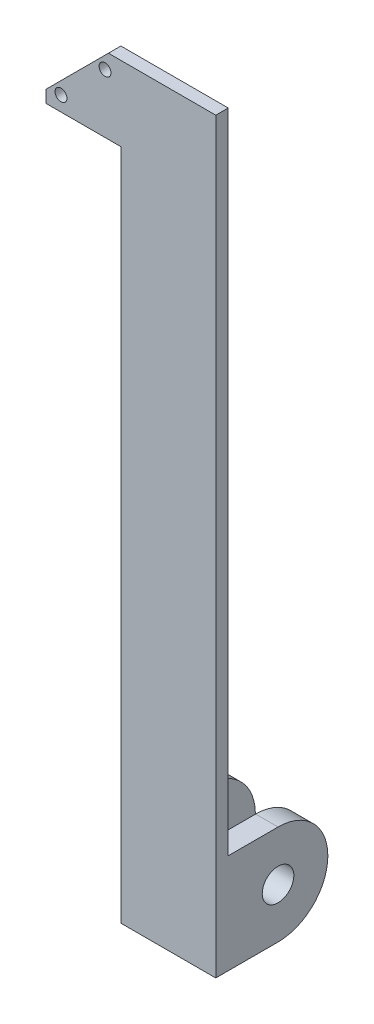
ISO-10303-21;
HEADER;
FILE_DESCRIPTION(('STEP AP214'),'2;1');
FILE_NAME('part.step','',(''),(''),'','','');
FILE_SCHEMA(('AUTOMOTIVE_DESIGN { 1 0 10303 214 1 1 1 1 }'));
ENDSEC;
DATA;
#1=APPLICATION_CONTEXT('core data for automotive mechanical design processes');
#2=APPLICATION_PROTOCOL_DEFINITION('international standard','automotive_design',2000,#1);
#3=PRODUCT_CONTEXT('',#1,'mechanical');
#4=PRODUCT('Part','Part','',(#3));
#5=PRODUCT_RELATED_PRODUCT_CATEGORY('part','',(#4));
#6=PRODUCT_DEFINITION_FORMATION('','',#4);
#7=PRODUCT_DEFINITION_CONTEXT('part definition',#1,'design');
#8=PRODUCT_DEFINITION('design','',#6,#7);
#9=PRODUCT_DEFINITION_SHAPE('','',#8);
#10=(LENGTH_UNIT() NAMED_UNIT(*) SI_UNIT(.MILLI.,.METRE.));
#11=(NAMED_UNIT(*) PLANE_ANGLE_UNIT() SI_UNIT($,.RADIAN.));
#12=(NAMED_UNIT(*) SI_UNIT($,.STERADIAN.) SOLID_ANGLE_UNIT());
#13=UNCERTAINTY_MEASURE_WITH_UNIT(LENGTH_MEASURE(1.E-05),#10,'distance_accuracy_value','');
#14=(GEOMETRIC_REPRESENTATION_CONTEXT(3) GLOBAL_UNCERTAINTY_ASSIGNED_CONTEXT((#13)) GLOBAL_UNIT_ASSIGNED_CONTEXT((#10,
#11,#12)) REPRESENTATION_CONTEXT('',''));
#15=CARTESIAN_POINT('',(0.,0.,0.));
#16=DIRECTION('',(0.,0.,1.));
#17=DIRECTION('',(1.,0.,0.));
#18=AXIS2_PLACEMENT_3D('',#15,#16,#17);
#19=CARTESIAN_POINT('',(0.,0.,5.));
#20=DIRECTION('',(-1.,0.,0.));
#21=DIRECTION('',(0.,0.,1.));
#22=AXIS2_PLACEMENT_3D('',#19,#20,#21);
#23=PLANE('',#22);
#24=CARTESIAN_POINT('',(0.,20.,-20.));
#25=DIRECTION('',(-1.,0.,0.));
#26=DIRECTION('',(0.,0.,1.));
#27=AXIS2_PLACEMENT_3D('',#24,#25,#26);
#28=CIRCLE('',#27,6.35);
#29=CARTESIAN_POINT('',(0.,20.,-13.65));
#30=VERTEX_POINT('',#29);
#31=EDGE_CURVE('E245',#30,#30,#28,.T.);
#32=ORIENTED_EDGE('',*,*,#31,.F.);
#33=EDGE_LOOP('',(#32));
#34=FACE_BOUND('',#33,.T.);
#35=DIRECTION('',(0.,1.,0.));
#36=VECTOR('',#35,1.);
#37=CARTESIAN_POINT('',(0.,0.,-40.));
#38=LINE('',#37,#36);
#39=CARTESIAN_POINT('',(0.,19.99,-40.));
#40=VERTEX_POINT('',#39);
#41=CARTESIAN_POINT('',(0.,20.0099999999999,-40.));
#42=VERTEX_POINT('',#41);
#43=EDGE_CURVE('E226',#40,#42,#38,.T.);
#44=ORIENTED_EDGE('',*,*,#43,.F.);
#45=CARTESIAN_POINT('',(0.,19.99,-20.01));
#46=DIRECTION('',(-1.,0.,0.));
#47=DIRECTION('',(0.,0.,1.));
#48=AXIS2_PLACEMENT_3D('',#45,#46,#47);
#49=CIRCLE('',#48,19.99);
#50=CARTESIAN_POINT('',(0.,0.,-20.0099999999999));
#51=VERTEX_POINT('',#50);
#52=EDGE_CURVE('E435',#40,#51,#49,.T.);
#53=ORIENTED_EDGE('',*,*,#52,.T.);
#54=DIRECTION('',(0.,0.,-1.));
#55=VECTOR('',#54,1.);
#56=CARTESIAN_POINT('',(0.,0.,5.));
#57=LINE('',#56,#55);
#58=CARTESIAN_POINT('',(0.,0.,5.));
#59=VERTEX_POINT('',#58);
#60=EDGE_CURVE('E205',#59,#51,#57,.T.);
#61=ORIENTED_EDGE('',*,*,#60,.F.);
#62=DIRECTION('',(0.,1.,0.));
#63=VECTOR('',#62,1.);
#64=CARTESIAN_POINT('',(0.,0.,5.));
#65=LINE('',#64,#63);
#66=CARTESIAN_POINT('',(0.,270.,5.));
#67=VERTEX_POINT('',#66);
#68=EDGE_CURVE('E279',#59,#67,#65,.T.);
#69=ORIENTED_EDGE('',*,*,#68,.T.);
#70=DIRECTION('',(0.,0.,-1.));
#71=VECTOR('',#70,1.);
#72=CARTESIAN_POINT('',(0.,270.,5.));
#73=LINE('',#72,#71);
#74=CARTESIAN_POINT('',(0.,270.,0.));
#75=VERTEX_POINT('',#74);
#76=EDGE_CURVE('E208',#67,#75,#73,.T.);
#77=ORIENTED_EDGE('',*,*,#76,.T.);
#78=DIRECTION('',(0.,1.,0.));
#79=VECTOR('',#78,1.);
#80=CARTESIAN_POINT('',(0.,0.,0.));
#81=LINE('',#80,#79);
#82=CARTESIAN_POINT('',(0.,40.,0.));
#83=VERTEX_POINT('',#82);
#84=EDGE_CURVE('E301',#83,#75,#81,.T.);
#85=ORIENTED_EDGE('',*,*,#84,.F.);
#86=DIRECTION('',(0.,0.,1.));
#87=VECTOR('',#86,1.);
#88=CARTESIAN_POINT('',(0.,40.,-40.));
#89=LINE('',#88,#87);
#90=CARTESIAN_POINT('',(0.,40.,-20.0099999999999));
#91=VERTEX_POINT('',#90);
#92=EDGE_CURVE('E239',#91,#83,#89,.T.);
#93=ORIENTED_EDGE('',*,*,#92,.F.);
#94=CARTESIAN_POINT('',(0.,20.01,-20.01));
#95=DIRECTION('',(-1.,0.,0.));
#96=DIRECTION('',(0.,0.,1.));
#97=AXIS2_PLACEMENT_3D('',#94,#95,#96);
#98=CIRCLE('',#97,19.99);
#99=EDGE_CURVE('E436',#91,#42,#98,.T.);
#100=ORIENTED_EDGE('',*,*,#99,.T.);
#101=EDGE_LOOP('',(#44,#53,#61,#69,#77,#85,#93,#100));
#102=FACE_BOUND('',#101,.T.);
#103=ADVANCED_FACE('F62',(#34,#102),#23,.T.);
#104=CARTESIAN_POINT('',(38.1,0.,5.));
#105=DIRECTION('',(-1.,0.,0.));
#106=DIRECTION('',(0.,-1.,0.));
#107=AXIS2_PLACEMENT_3D('',#104,#105,#106);
#108=PLANE('',#107);
#109=CARTESIAN_POINT('',(38.1,20.,-20.));
#110=DIRECTION('',(1.,0.,0.));
#111=DIRECTION('',(0.,1.,0.));
#112=AXIS2_PLACEMENT_3D('',#109,#110,#111);
#113=CIRCLE('',#112,6.35);
#114=CARTESIAN_POINT('',(38.1,26.35,-20.));
#115=VERTEX_POINT('',#114);
#116=EDGE_CURVE('E454',#115,#115,#113,.T.);
#117=ORIENTED_EDGE('',*,*,#116,.F.);
#118=EDGE_LOOP('',(#117));
#119=FACE_BOUND('',#118,.T.);
#120=CARTESIAN_POINT('',(38.1,19.99,-20.01));
#121=DIRECTION('',(1.,0.,0.));
#122=DIRECTION('',(0.,1.,0.));
#123=AXIS2_PLACEMENT_3D('',#120,#121,#122);
#124=CIRCLE('',#123,19.99);
#125=CARTESIAN_POINT('',(38.1,0.,-20.0099999999999));
#126=VERTEX_POINT('',#125);
#127=CARTESIAN_POINT('',(38.1,19.9900000000001,-40.));
#128=VERTEX_POINT('',#127);
#129=EDGE_CURVE('E179',#126,#128,#124,.T.);
#130=ORIENTED_EDGE('',*,*,#129,.T.);
#131=DIRECTION('',(0.,-1.,0.));
#132=VECTOR('',#131,1.);
#133=CARTESIAN_POINT('',(38.1,0.,-40.));
#134=LINE('',#133,#132);
#135=CARTESIAN_POINT('',(38.1,20.0099999999999,-40.));
#136=VERTEX_POINT('',#135);
#137=EDGE_CURVE('E259',#136,#128,#134,.T.);
#138=ORIENTED_EDGE('',*,*,#137,.F.);
#139=CARTESIAN_POINT('',(38.1,20.01,-20.01));
#140=DIRECTION('',(1.,0.,0.));
#141=DIRECTION('',(0.,1.,0.));
#142=AXIS2_PLACEMENT_3D('',#139,#140,#141);
#143=CIRCLE('',#142,19.99);
#144=CARTESIAN_POINT('',(38.1,40.,-20.0099999999999));
#145=VERTEX_POINT('',#144);
#146=EDGE_CURVE('E78',#136,#145,#143,.T.);
#147=ORIENTED_EDGE('',*,*,#146,.T.);
#148=DIRECTION('',(0.,0.,1.));
#149=VECTOR('',#148,1.);
#150=CARTESIAN_POINT('',(38.1,40.,-40.));
#151=LINE('',#150,#149);
#152=CARTESIAN_POINT('',(38.1,40.,0.));
#153=VERTEX_POINT('',#152);
#154=EDGE_CURVE('E267',#145,#153,#151,.T.);
#155=ORIENTED_EDGE('',*,*,#154,.T.);
#156=DIRECTION('',(0.,1.,0.));
#157=VECTOR('',#156,1.);
#158=CARTESIAN_POINT('',(38.1,0.,0.));
#159=LINE('',#158,#157);
#160=CARTESIAN_POINT('',(38.0999999999999,300.,0.));
#161=VERTEX_POINT('',#160);
#162=EDGE_CURVE('E305',#153,#161,#159,.T.);
#163=ORIENTED_EDGE('',*,*,#162,.T.);
#164=DIRECTION('',(0.,0.,-1.));
#165=VECTOR('',#164,1.);
#166=CARTESIAN_POINT('',(38.0999999999999,300.,5.));
#167=LINE('',#166,#165);
#168=CARTESIAN_POINT('',(38.0999999999999,300.,5.));
#169=VERTEX_POINT('',#168);
#170=EDGE_CURVE('E206',#169,#161,#167,.T.);
#171=ORIENTED_EDGE('',*,*,#170,.F.);
#172=DIRECTION('',(0.,1.,0.));
#173=VECTOR('',#172,1.);
#174=CARTESIAN_POINT('',(38.1,0.,5.));
#175=LINE('',#174,#173);
#176=CARTESIAN_POINT('',(38.1,0.,5.));
#177=VERTEX_POINT('',#176);
#178=EDGE_CURVE('E203',#177,#169,#175,.T.);
#179=ORIENTED_EDGE('',*,*,#178,.F.);
#180=DIRECTION('',(0.,0.,-1.));
#181=VECTOR('',#180,1.);
#182=CARTESIAN_POINT('',(38.1,0.,5.));
#183=LINE('',#182,#181);
#184=EDGE_CURVE('E195',#177,#126,#183,.T.);
#185=ORIENTED_EDGE('',*,*,#184,.T.);
#186=EDGE_LOOP('',(#130,#138,#147,#155,#163,#171,#179,#185));
#187=FACE_BOUND('',#186,.T.);
#188=ADVANCED_FACE('F200',(#119,#187),#108,.F.);
#189=CARTESIAN_POINT('',(29.1,0.,-40.));
#190=DIRECTION('',(-1.,0.,0.));
#191=DIRECTION('',(0.,-1.,0.));
#192=AXIS2_PLACEMENT_3D('',#189,#190,#191);
#193=PLANE('',#192);
#194=CARTESIAN_POINT('',(29.1,20.,-20.));
#195=DIRECTION('',(-1.,0.,0.));
#196=DIRECTION('',(0.,-1.,0.));
#197=AXIS2_PLACEMENT_3D('',#194,#195,#196);
#198=CIRCLE('',#197,6.35);
#199=CARTESIAN_POINT('',(29.1,13.65,-20.));
#200=VERTEX_POINT('',#199);
#201=EDGE_CURVE('E444',#200,#200,#198,.T.);
#202=ORIENTED_EDGE('',*,*,#201,.F.);
#203=EDGE_LOOP('',(#202));
#204=FACE_BOUND('',#203,.T.);
#205=DIRECTION('',(0.,-1.,0.));
#206=VECTOR('',#205,1.);
#207=CARTESIAN_POINT('',(29.1,0.,-40.));
#208=LINE('',#207,#206);
#209=CARTESIAN_POINT('',(29.1,20.0099999999999,-40.));
#210=VERTEX_POINT('',#209);
#211=CARTESIAN_POINT('',(29.1,19.99,-40.));
#212=VERTEX_POINT('',#211);
#213=EDGE_CURVE('E256',#210,#212,#208,.T.);
#214=ORIENTED_EDGE('',*,*,#213,.T.);
#215=CARTESIAN_POINT('',(29.1,19.99,-20.01));
#216=DIRECTION('',(-1.,0.,0.));
#217=DIRECTION('',(0.,-1.,0.));
#218=AXIS2_PLACEMENT_3D('',#215,#216,#217);
#219=CIRCLE('',#218,19.99);
#220=CARTESIAN_POINT('',(29.1,0.,-20.0099999999999));
#221=VERTEX_POINT('',#220);
#222=EDGE_CURVE('E86',#212,#221,#219,.T.);
#223=ORIENTED_EDGE('',*,*,#222,.T.);
#224=DIRECTION('',(0.,0.,1.));
#225=VECTOR('',#224,1.);
#226=CARTESIAN_POINT('',(29.1,0.,-40.));
#227=LINE('',#226,#225);
#228=CARTESIAN_POINT('',(29.1,0.,0.));
#229=VERTEX_POINT('',#228);
#230=EDGE_CURVE('E197',#221,#229,#227,.T.);
#231=ORIENTED_EDGE('',*,*,#230,.T.);
#232=DIRECTION('',(0.,-1.,0.));
#233=VECTOR('',#232,1.);
#234=CARTESIAN_POINT('',(29.1,0.,0.));
#235=LINE('',#234,#233);
#236=CARTESIAN_POINT('',(29.1,40.,0.));
#237=VERTEX_POINT('',#236);
#238=EDGE_CURVE('E255',#237,#229,#235,.T.);
#239=ORIENTED_EDGE('',*,*,#238,.F.);
#240=DIRECTION('',(0.,0.,1.));
#241=VECTOR('',#240,1.);
#242=CARTESIAN_POINT('',(29.1,40.,-40.));
#243=LINE('',#242,#241);
#244=CARTESIAN_POINT('',(29.1,40.,-20.0099999999999));
#245=VERTEX_POINT('',#244);
#246=EDGE_CURVE('E269',#245,#237,#243,.T.);
#247=ORIENTED_EDGE('',*,*,#246,.F.);
#248=CARTESIAN_POINT('',(29.1,20.01,-20.01));
#249=DIRECTION('',(-1.,0.,0.));
#250=DIRECTION('',(0.,-1.,0.));
#251=AXIS2_PLACEMENT_3D('',#248,#249,#250);
#252=CIRCLE('',#251,19.99);
#253=EDGE_CURVE('E437',#245,#210,#252,.T.);
#254=ORIENTED_EDGE('',*,*,#253,.T.);
#255=EDGE_LOOP('',(#214,#223,#231,#239,#247,#254));
#256=FACE_BOUND('',#255,.T.);
#257=ADVANCED_FACE('F355',(#204,#256),#193,.T.);
#258=CARTESIAN_POINT('',(0.,0.,-40.));
#259=DIRECTION('',(0.,0.,-1.));
#260=DIRECTION('',(-1.,0.,0.));
#261=AXIS2_PLACEMENT_3D('',#258,#259,#260);
#262=PLANE('',#261);
#263=DIRECTION('',(1.,0.,0.));
#264=VECTOR('',#263,1.);
#265=CARTESIAN_POINT('',(-1.90000000000001,19.9900000000001,-40.));
#266=LINE('',#265,#264);
#267=EDGE_CURVE('E183',#212,#128,#266,.T.);
#268=ORIENTED_EDGE('',*,*,#267,.F.);
#269=ORIENTED_EDGE('',*,*,#213,.F.);
#270=DIRECTION('',(1.,0.,0.));
#271=VECTOR('',#270,1.);
#272=CARTESIAN_POINT('',(-1.90000000000001,20.0099999999999,-40.));
#273=LINE('',#272,#271);
#274=EDGE_CURVE('E456',#210,#136,#273,.T.);
#275=ORIENTED_EDGE('',*,*,#274,.T.);
#276=ORIENTED_EDGE('',*,*,#137,.T.);
#277=EDGE_LOOP('',(#268,#269,#275,#276));
#278=FACE_BOUND('',#277,.T.);
#279=ADVANCED_FACE('F402',(#278),#262,.T.);
#280=CARTESIAN_POINT('',(8.99999999999999,0.,-40.));
#281=DIRECTION('',(-1.,0.,0.));
#282=DIRECTION('',(0.,-1.,0.));
#283=AXIS2_PLACEMENT_3D('',#280,#281,#282);
#284=PLANE('',#283);
#285=CARTESIAN_POINT('',(9.,20.,-20.));
#286=DIRECTION('',(-1.,0.,0.));
#287=DIRECTION('',(0.,-1.,0.));
#288=AXIS2_PLACEMENT_3D('',#285,#286,#287);
#289=CIRCLE('',#288,6.35);
#290=CARTESIAN_POINT('',(9.,13.65,-20.));
#291=VERTEX_POINT('',#290);
#292=EDGE_CURVE('E66',#291,#291,#289,.T.);
#293=ORIENTED_EDGE('',*,*,#292,.T.);
#294=EDGE_LOOP('',(#293));
#295=FACE_BOUND('',#294,.T.);
#296=CARTESIAN_POINT('',(9.,19.99,-20.01));
#297=DIRECTION('',(-1.,0.,0.));
#298=DIRECTION('',(0.,-1.,0.));
#299=AXIS2_PLACEMENT_3D('',#296,#297,#298);
#300=CIRCLE('',#299,19.99);
#301=CARTESIAN_POINT('',(9.,19.9900000000001,-40.));
#302=VERTEX_POINT('',#301);
#303=CARTESIAN_POINT('',(8.99999999999999,0.,-20.0099999999999));
#304=VERTEX_POINT('',#303);
#305=EDGE_CURVE('E236',#302,#304,#300,.T.);
#306=ORIENTED_EDGE('',*,*,#305,.F.);
#307=DIRECTION('',(0.,-1.,0.));
#308=VECTOR('',#307,1.);
#309=CARTESIAN_POINT('',(8.99999999999999,0.,-40.));
#310=LINE('',#309,#308);
#311=CARTESIAN_POINT('',(9.,20.01,-40.));
#312=VERTEX_POINT('',#311);
#313=EDGE_CURVE('E224',#312,#302,#310,.T.);
#314=ORIENTED_EDGE('',*,*,#313,.F.);
#315=CARTESIAN_POINT('',(9.,20.01,-20.01));
#316=DIRECTION('',(-1.,0.,0.));
#317=DIRECTION('',(0.,-1.,0.));
#318=AXIS2_PLACEMENT_3D('',#315,#316,#317);
#319=CIRCLE('',#318,19.99);
#320=CARTESIAN_POINT('',(9.,40.,-20.0099999999999));
#321=VERTEX_POINT('',#320);
#322=EDGE_CURVE('E233',#321,#312,#319,.T.);
#323=ORIENTED_EDGE('',*,*,#322,.F.);
#324=DIRECTION('',(0.,0.,1.));
#325=VECTOR('',#324,1.);
#326=CARTESIAN_POINT('',(9.,40.,-40.));
#327=LINE('',#326,#325);
#328=CARTESIAN_POINT('',(9.,40.,0.));
#329=VERTEX_POINT('',#328);
#330=EDGE_CURVE('E253',#321,#329,#327,.T.);
#331=ORIENTED_EDGE('',*,*,#330,.T.);
#332=DIRECTION('',(0.,-1.,0.));
#333=VECTOR('',#332,1.);
#334=CARTESIAN_POINT('',(8.99999999999999,0.,0.));
#335=LINE('',#334,#333);
#336=CARTESIAN_POINT('',(8.99999999999999,0.,0.));
#337=VERTEX_POINT('',#336);
#338=EDGE_CURVE('E237',#329,#337,#335,.T.);
#339=ORIENTED_EDGE('',*,*,#338,.T.);
#340=DIRECTION('',(0.,0.,1.));
#341=VECTOR('',#340,1.);
#342=CARTESIAN_POINT('',(8.99999999999999,0.,-40.));
#343=LINE('',#342,#341);
#344=EDGE_CURVE('E251',#304,#337,#343,.T.);
#345=ORIENTED_EDGE('',*,*,#344,.F.);
#346=EDGE_LOOP('',(#306,#314,#323,#331,#339,#345));
#347=FACE_BOUND('',#346,.T.);
#348=ADVANCED_FACE('F232',(#295,#347),#284,.F.);
#349=CARTESIAN_POINT('',(0.,0.,-40.));
#350=DIRECTION('',(0.,0.,-1.));
#351=DIRECTION('',(-1.,0.,0.));
#352=AXIS2_PLACEMENT_3D('',#349,#350,#351);
#353=PLANE('',#352);
#354=DIRECTION('',(1.,0.,0.));
#355=VECTOR('',#354,1.);
#356=CARTESIAN_POINT('',(-1.90000000000001,19.99,-40.));
#357=LINE('',#356,#355);
#358=EDGE_CURVE('E12',#40,#302,#357,.T.);
#359=ORIENTED_EDGE('',*,*,#358,.F.);
#360=ORIENTED_EDGE('',*,*,#43,.T.);
#361=DIRECTION('',(1.,0.,0.));
#362=VECTOR('',#361,1.);
#363=CARTESIAN_POINT('',(-1.90000000000001,20.01,-40.));
#364=LINE('',#363,#362);
#365=EDGE_CURVE('E71',#42,#312,#364,.T.);
#366=ORIENTED_EDGE('',*,*,#365,.T.);
#367=ORIENTED_EDGE('',*,*,#313,.T.);
#368=EDGE_LOOP('',(#359,#360,#366,#367));
#369=FACE_BOUND('',#368,.T.);
#370=ADVANCED_FACE('F223',(#369),#353,.T.);
#371=CARTESIAN_POINT('',(0.,270.,5.));
#372=DIRECTION('',(0.,-1.,0.));
#373=DIRECTION('',(0.,0.,-1.));
#374=AXIS2_PLACEMENT_3D('',#371,#372,#373);
#375=PLANE('',#374);
#376=DIRECTION('',(-1.,0.,0.));
#377=VECTOR('',#376,1.);
#378=CARTESIAN_POINT('',(0.,270.,0.));
#379=LINE('',#378,#377);
#380=CARTESIAN_POINT('',(-29.9999999999999,270.,0.));
#381=VERTEX_POINT('',#380);
#382=EDGE_CURVE('E298',#75,#381,#379,.T.);
#383=ORIENTED_EDGE('',*,*,#382,.F.);
#384=ORIENTED_EDGE('',*,*,#76,.F.);
#385=DIRECTION('',(-1.,0.,0.));
#386=VECTOR('',#385,1.);
#387=CARTESIAN_POINT('',(0.,270.,5.));
#388=LINE('',#387,#386);
#389=CARTESIAN_POINT('',(-29.9999999999999,270.,5.));
#390=VERTEX_POINT('',#389);
#391=EDGE_CURVE('E275',#67,#390,#388,.T.);
#392=ORIENTED_EDGE('',*,*,#391,.T.);
#393=DIRECTION('',(0.,0.,-1.));
#394=VECTOR('',#393,1.);
#395=CARTESIAN_POINT('',(-29.9999999999999,270.,5.));
#396=LINE('',#395,#394);
#397=EDGE_CURVE('E295',#390,#381,#396,.T.);
#398=ORIENTED_EDGE('',*,*,#397,.T.);
#399=EDGE_LOOP('',(#383,#384,#392,#398));
#400=FACE_BOUND('',#399,.T.);
#401=ADVANCED_FACE('F366',(#400),#375,.T.);
#402=CARTESIAN_POINT('',(0.,0.,5.));
#403=DIRECTION('',(0.,1.,0.));
#404=DIRECTION('',(0.,0.,1.));
#405=AXIS2_PLACEMENT_3D('',#402,#403,#404);
#406=PLANE('',#405);
#407=ORIENTED_EDGE('',*,*,#60,.T.);
#408=DIRECTION('',(1.,0.,0.));
#409=VECTOR('',#408,1.);
#410=CARTESIAN_POINT('',(-1.90000000000001,0.,-20.0099999999999));
#411=LINE('',#410,#409);
#412=EDGE_CURVE('E198',#51,#304,#411,.T.);
#413=ORIENTED_EDGE('',*,*,#412,.T.);
#414=ORIENTED_EDGE('',*,*,#344,.T.);
#415=DIRECTION('',(1.,0.,0.));
#416=VECTOR('',#415,1.);
#417=CARTESIAN_POINT('',(0.,0.,0.));
#418=LINE('',#417,#416);
#419=EDGE_CURVE('E303',#337,#229,#418,.T.);
#420=ORIENTED_EDGE('',*,*,#419,.T.);
#421=ORIENTED_EDGE('',*,*,#230,.F.);
#422=EDGE_CURVE('E182',#221,#126,#411,.T.);
#423=ORIENTED_EDGE('',*,*,#422,.T.);
#424=ORIENTED_EDGE('',*,*,#184,.F.);
#425=DIRECTION('',(1.,0.,0.));
#426=VECTOR('',#425,1.);
#427=CARTESIAN_POINT('',(0.,0.,5.));
#428=LINE('',#427,#426);
#429=EDGE_CURVE('E282',#59,#177,#428,.T.);
#430=ORIENTED_EDGE('',*,*,#429,.F.);
#431=EDGE_LOOP('',(#407,#413,#414,#420,#421,#423,#424,#430));
#432=FACE_BOUND('',#431,.T.);
#433=ADVANCED_FACE('F193',(#432),#406,.F.);
#434=CARTESIAN_POINT('',(0.,300.,5.));
#435=DIRECTION('',(0.,-1.,0.));
#436=DIRECTION('',(0.,0.,-1.));
#437=AXIS2_PLACEMENT_3D('',#434,#435,#436);
#438=PLANE('',#437);
#439=DIRECTION('',(-1.,0.,0.));
#440=VECTOR('',#439,1.);
#441=CARTESIAN_POINT('',(0.,300.,0.));
#442=LINE('',#441,#440);
#443=CARTESIAN_POINT('',(-4.9999999999999,300.,0.));
#444=VERTEX_POINT('',#443);
#445=EDGE_CURVE('E307',#161,#444,#442,.T.);
#446=ORIENTED_EDGE('',*,*,#445,.T.);
#447=DIRECTION('',(0.,0.,-1.));
#448=VECTOR('',#447,1.);
#449=CARTESIAN_POINT('',(-4.9999999999999,300.,5.));
#450=LINE('',#449,#448);
#451=CARTESIAN_POINT('',(-4.9999999999999,300.,5.));
#452=VERTEX_POINT('',#451);
#453=EDGE_CURVE('E211',#452,#444,#450,.T.);
#454=ORIENTED_EDGE('',*,*,#453,.F.);
#455=DIRECTION('',(-1.,0.,0.));
#456=VECTOR('',#455,1.);
#457=CARTESIAN_POINT('',(0.,300.,5.));
#458=LINE('',#457,#456);
#459=EDGE_CURVE('E285',#169,#452,#458,.T.);
#460=ORIENTED_EDGE('',*,*,#459,.F.);
#461=ORIENTED_EDGE('',*,*,#170,.T.);
#462=EDGE_LOOP('',(#446,#454,#460,#461));
#463=FACE_BOUND('',#462,.T.);
#464=ADVANCED_FACE('F327',(#463),#438,.F.);
#465=CARTESIAN_POINT('',(-152.5,152.5,5.));
#466=DIRECTION('',(-0.707106781186547,0.707106781186548,0.));
#467=DIRECTION('',(-0.707106781186548,-0.707106781186547,0.));
#468=AXIS2_PLACEMENT_3D('',#465,#466,#467);
#469=PLANE('',#468);
#470=DIRECTION('',(0.707106781186548,0.707106781186547,0.));
#471=VECTOR('',#470,1.);
#472=CARTESIAN_POINT('',(-152.5,152.5,0.));
#473=LINE('',#472,#471);
#474=CARTESIAN_POINT('',(-30.,275.,0.));
#475=VERTEX_POINT('',#474);
#476=EDGE_CURVE('E310',#475,#444,#473,.T.);
#477=ORIENTED_EDGE('',*,*,#476,.F.);
#478=DIRECTION('',(0.,0.,-1.));
#479=VECTOR('',#478,1.);
#480=CARTESIAN_POINT('',(-30.,275.,5.));
#481=LINE('',#480,#479);
#482=CARTESIAN_POINT('',(-30.,275.,5.));
#483=VERTEX_POINT('',#482);
#484=EDGE_CURVE('E319',#483,#475,#481,.T.);
#485=ORIENTED_EDGE('',*,*,#484,.F.);
#486=DIRECTION('',(0.707106781186548,0.707106781186547,0.));
#487=VECTOR('',#486,1.);
#488=CARTESIAN_POINT('',(-152.5,152.5,5.));
#489=LINE('',#488,#487);
#490=EDGE_CURVE('E287',#483,#452,#489,.T.);
#491=ORIENTED_EDGE('',*,*,#490,.T.);
#492=ORIENTED_EDGE('',*,*,#453,.T.);
#493=EDGE_LOOP('',(#477,#485,#491,#492));
#494=FACE_BOUND('',#493,.T.);
#495=ADVANCED_FACE('F323',(#494),#469,.T.);
#496=CARTESIAN_POINT('',(-30.,0.,5.));
#497=DIRECTION('',(1.,0.,0.));
#498=DIRECTION('',(0.,0.,-1.));
#499=AXIS2_PLACEMENT_3D('',#496,#497,#498);
#500=PLANE('',#499);
#501=DIRECTION('',(0.,-1.,0.));
#502=VECTOR('',#501,1.);
#503=CARTESIAN_POINT('',(-30.,0.,0.));
#504=LINE('',#503,#502);
#505=EDGE_CURVE('E313',#475,#381,#504,.T.);
#506=ORIENTED_EDGE('',*,*,#505,.T.);
#507=ORIENTED_EDGE('',*,*,#397,.F.);
#508=DIRECTION('',(0.,-1.,0.));
#509=VECTOR('',#508,1.);
#510=CARTESIAN_POINT('',(-30.,0.,5.));
#511=LINE('',#510,#509);
#512=EDGE_CURVE('E290',#483,#390,#511,.T.);
#513=ORIENTED_EDGE('',*,*,#512,.F.);
#514=ORIENTED_EDGE('',*,*,#484,.T.);
#515=EDGE_LOOP('',(#506,#507,#513,#514));
#516=FACE_BOUND('',#515,.T.);
#517=ADVANCED_FACE('F337',(#516),#500,.F.);
#518=CARTESIAN_POINT('',(-6.36396103067894,293.636038969321,5.));
#519=DIRECTION('',(0.,0.,-1.));
#520=DIRECTION('',(-1.,0.,0.));
#521=AXIS2_PLACEMENT_3D('',#518,#519,#520);
#522=CYLINDRICAL_SURFACE('',#521,2.38125000000002);
#523=CARTESIAN_POINT('',(-6.36396103067894,293.636038969321,5.));
#524=DIRECTION('',(0.,0.,1.));
#525=DIRECTION('',(1.,0.,0.));
#526=AXIS2_PLACEMENT_3D('',#523,#524,#525);
#527=CIRCLE('',#526,2.38125000000002);
#528=CARTESIAN_POINT('',(-3.98271103067892,293.636038969321,5.));
#529=VERTEX_POINT('',#528);
#530=EDGE_CURVE('E272',#529,#529,#527,.T.);
#531=ORIENTED_EDGE('',*,*,#530,.T.);
#532=EDGE_LOOP('',(#531));
#533=FACE_BOUND('',#532,.T.);
#534=CARTESIAN_POINT('',(-6.36396103067894,293.636038969321,0.));
#535=DIRECTION('',(0.,0.,1.));
#536=DIRECTION('',(1.,0.,0.));
#537=AXIS2_PLACEMENT_3D('',#534,#535,#536);
#538=CIRCLE('',#537,2.38125000000002);
#539=CARTESIAN_POINT('',(-3.98271103067892,293.636038969321,0.));
#540=VERTEX_POINT('',#539);
#541=EDGE_CURVE('E271',#540,#540,#538,.T.);
#542=ORIENTED_EDGE('',*,*,#541,.F.);
#543=EDGE_LOOP('',(#542));
#544=FACE_BOUND('',#543,.T.);
#545=ADVANCED_FACE('F64',(#533,#544),#522,.F.);
#546=CARTESIAN_POINT('',(-24.0416305603427,275.958369439657,5.));
#547=DIRECTION('',(0.,0.,-1.));
#548=DIRECTION('',(-1.,0.,0.));
#549=AXIS2_PLACEMENT_3D('',#546,#547,#548);
#550=CYLINDRICAL_SURFACE('',#549,2.38125000000002);
#551=CARTESIAN_POINT('',(-24.0416305603427,275.958369439657,5.));
#552=DIRECTION('',(0.,0.,1.));
#553=DIRECTION('',(1.,0.,0.));
#554=AXIS2_PLACEMENT_3D('',#551,#552,#553);
#555=CIRCLE('',#554,2.38125000000002);
#556=CARTESIAN_POINT('',(-21.6603805603427,275.958369439657,5.));
#557=VERTEX_POINT('',#556);
#558=EDGE_CURVE('E292',#557,#557,#555,.T.);
#559=ORIENTED_EDGE('',*,*,#558,.T.);
#560=EDGE_LOOP('',(#559));
#561=FACE_BOUND('',#560,.T.);
#562=CARTESIAN_POINT('',(-24.0416305603427,275.958369439657,0.));
#563=DIRECTION('',(0.,0.,1.));
#564=DIRECTION('',(1.,0.,0.));
#565=AXIS2_PLACEMENT_3D('',#562,#563,#564);
#566=CIRCLE('',#565,2.38125000000002);
#567=CARTESIAN_POINT('',(-21.6603805603427,275.958369439657,0.));
#568=VERTEX_POINT('',#567);
#569=EDGE_CURVE('E276',#568,#568,#566,.T.);
#570=ORIENTED_EDGE('',*,*,#569,.F.);
#571=EDGE_LOOP('',(#570));
#572=FACE_BOUND('',#571,.T.);
#573=ADVANCED_FACE('F390',(#561,#572),#550,.F.);
#574=CARTESIAN_POINT('',(0.,0.,5.));
#575=DIRECTION('',(0.,0.,1.));
#576=DIRECTION('',(1.,0.,0.));
#577=AXIS2_PLACEMENT_3D('',#574,#575,#576);
#578=PLANE('',#577);
#579=ORIENTED_EDGE('',*,*,#530,.F.);
#580=EDGE_LOOP('',(#579));
#581=FACE_BOUND('',#580,.T.);
#582=ORIENTED_EDGE('',*,*,#391,.F.);
#583=ORIENTED_EDGE('',*,*,#68,.F.);
#584=ORIENTED_EDGE('',*,*,#429,.T.);
#585=ORIENTED_EDGE('',*,*,#178,.T.);
#586=ORIENTED_EDGE('',*,*,#459,.T.);
#587=ORIENTED_EDGE('',*,*,#490,.F.);
#588=ORIENTED_EDGE('',*,*,#512,.T.);
#589=EDGE_LOOP('',(#582,#583,#584,#585,#586,#587,#588));
#590=FACE_BOUND('',#589,.T.);
#591=ORIENTED_EDGE('',*,*,#558,.F.);
#592=EDGE_LOOP('',(#591));
#593=FACE_BOUND('',#592,.T.);
#594=ADVANCED_FACE('F341',(#581,#590,#593),#578,.T.);
#595=CARTESIAN_POINT('',(0.,0.,0.));
#596=DIRECTION('',(0.,0.,1.));
#597=DIRECTION('',(1.,0.,0.));
#598=AXIS2_PLACEMENT_3D('',#595,#596,#597);
#599=PLANE('',#598);
#600=ORIENTED_EDGE('',*,*,#541,.T.);
#601=EDGE_LOOP('',(#600));
#602=FACE_BOUND('',#601,.T.);
#603=ORIENTED_EDGE('',*,*,#338,.F.);
#604=DIRECTION('',(-1.,0.,0.));
#605=VECTOR('',#604,1.);
#606=CARTESIAN_POINT('',(0.,40.,0.));
#607=LINE('',#606,#605);
#608=EDGE_CURVE('E242',#329,#83,#607,.T.);
#609=ORIENTED_EDGE('',*,*,#608,.T.);
#610=ORIENTED_EDGE('',*,*,#84,.T.);
#611=ORIENTED_EDGE('',*,*,#382,.T.);
#612=ORIENTED_EDGE('',*,*,#505,.F.);
#613=ORIENTED_EDGE('',*,*,#476,.T.);
#614=ORIENTED_EDGE('',*,*,#445,.F.);
#615=ORIENTED_EDGE('',*,*,#162,.F.);
#616=DIRECTION('',(-1.,0.,0.));
#617=VECTOR('',#616,1.);
#618=CARTESIAN_POINT('',(0.,40.,0.));
#619=LINE('',#618,#617);
#620=EDGE_CURVE('E260',#153,#237,#619,.T.);
#621=ORIENTED_EDGE('',*,*,#620,.T.);
#622=ORIENTED_EDGE('',*,*,#238,.T.);
#623=ORIENTED_EDGE('',*,*,#419,.F.);
#624=EDGE_LOOP('',(#603,#609,#610,#611,#612,#613,#614,#615,#621,#622,#623));
#625=FACE_BOUND('',#624,.T.);
#626=ORIENTED_EDGE('',*,*,#569,.T.);
#627=EDGE_LOOP('',(#626));
#628=FACE_BOUND('',#627,.T.);
#629=ADVANCED_FACE('F332',(#602,#625,#628),#599,.F.);
#630=CARTESIAN_POINT('',(0.,40.,-40.));
#631=DIRECTION('',(0.,1.,0.));
#632=DIRECTION('',(0.,0.,1.));
#633=AXIS2_PLACEMENT_3D('',#630,#631,#632);
#634=PLANE('',#633);
#635=DIRECTION('',(1.,0.,0.));
#636=VECTOR('',#635,1.);
#637=CARTESIAN_POINT('',(-1.90000000000001,40.,-20.0099999999999));
#638=LINE('',#637,#636);
#639=EDGE_CURVE('E352',#245,#145,#638,.T.);
#640=ORIENTED_EDGE('',*,*,#639,.F.);
#641=ORIENTED_EDGE('',*,*,#246,.T.);
#642=ORIENTED_EDGE('',*,*,#620,.F.);
#643=ORIENTED_EDGE('',*,*,#154,.F.);
#644=EDGE_LOOP('',(#640,#641,#642,#643));
#645=FACE_BOUND('',#644,.T.);
#646=ADVANCED_FACE('F350',(#645),#634,.T.);
#647=CARTESIAN_POINT('',(0.,40.,-40.));
#648=DIRECTION('',(0.,1.,0.));
#649=DIRECTION('',(0.,0.,1.));
#650=AXIS2_PLACEMENT_3D('',#647,#648,#649);
#651=PLANE('',#650);
#652=EDGE_CURVE('E361',#91,#321,#638,.T.);
#653=ORIENTED_EDGE('',*,*,#652,.F.);
#654=ORIENTED_EDGE('',*,*,#92,.T.);
#655=ORIENTED_EDGE('',*,*,#608,.F.);
#656=ORIENTED_EDGE('',*,*,#330,.F.);
#657=EDGE_LOOP('',(#653,#654,#655,#656));
#658=FACE_BOUND('',#657,.T.);
#659=ADVANCED_FACE('F360',(#658),#651,.T.);
#660=CARTESIAN_POINT('',(-1.90000000000001,20.01,-20.01));
#661=DIRECTION('',(1.,0.,0.));
#662=DIRECTION('',(0.,1.,0.));
#663=AXIS2_PLACEMENT_3D('',#660,#661,#662);
#664=CYLINDRICAL_SURFACE('',#663,19.99);
#665=ORIENTED_EDGE('',*,*,#652,.T.);
#666=ORIENTED_EDGE('',*,*,#322,.T.);
#667=ORIENTED_EDGE('',*,*,#365,.F.);
#668=ORIENTED_EDGE('',*,*,#99,.F.);
#669=EDGE_LOOP('',(#665,#666,#667,#668));
#670=FACE_BOUND('',#669,.T.);
#671=ADVANCED_FACE('F411',(#670),#664,.T.);
#672=CARTESIAN_POINT('',(-1.90000000000001,19.99,-20.01));
#673=DIRECTION('',(1.,0.,0.));
#674=DIRECTION('',(0.,1.,0.));
#675=AXIS2_PLACEMENT_3D('',#672,#673,#674);
#676=CYLINDRICAL_SURFACE('',#675,19.99);
#677=ORIENTED_EDGE('',*,*,#358,.T.);
#678=ORIENTED_EDGE('',*,*,#305,.T.);
#679=ORIENTED_EDGE('',*,*,#412,.F.);
#680=ORIENTED_EDGE('',*,*,#52,.F.);
#681=EDGE_LOOP('',(#677,#678,#679,#680));
#682=FACE_BOUND('',#681,.T.);
#683=ADVANCED_FACE('F424',(#682),#676,.T.);
#684=CARTESIAN_POINT('',(-1.90000000000001,20.,-20.));
#685=DIRECTION('',(1.,0.,0.));
#686=DIRECTION('',(0.,1.,0.));
#687=AXIS2_PLACEMENT_3D('',#684,#685,#686);
#688=CYLINDRICAL_SURFACE('',#687,6.35);
#689=ORIENTED_EDGE('',*,*,#31,.T.);
#690=EDGE_LOOP('',(#689));
#691=FACE_BOUND('',#690,.T.);
#692=ORIENTED_EDGE('',*,*,#292,.F.);
#693=EDGE_LOOP('',(#692));
#694=FACE_BOUND('',#693,.T.);
#695=ADVANCED_FACE('F418',(#691,#694),#688,.F.);
#696=ORIENTED_EDGE('',*,*,#639,.T.);
#697=ORIENTED_EDGE('',*,*,#146,.F.);
#698=ORIENTED_EDGE('',*,*,#274,.F.);
#699=ORIENTED_EDGE('',*,*,#253,.F.);
#700=EDGE_LOOP('',(#696,#697,#698,#699));
#701=FACE_BOUND('',#700,.T.);
#702=ADVANCED_FACE('F415',(#701),#664,.T.);
#703=ORIENTED_EDGE('',*,*,#267,.T.);
#704=ORIENTED_EDGE('',*,*,#129,.F.);
#705=ORIENTED_EDGE('',*,*,#422,.F.);
#706=ORIENTED_EDGE('',*,*,#222,.F.);
#707=EDGE_LOOP('',(#703,#704,#705,#706));
#708=FACE_BOUND('',#707,.T.);
#709=ADVANCED_FACE('F181',(#708),#676,.T.);
#710=ORIENTED_EDGE('',*,*,#201,.T.);
#711=EDGE_LOOP('',(#710));
#712=FACE_BOUND('',#711,.T.);
#713=ORIENTED_EDGE('',*,*,#116,.T.);
#714=EDGE_LOOP('',(#713));
#715=FACE_BOUND('',#714,.T.);
#716=ADVANCED_FACE('F419',(#712,#715),#688,.F.);
#717=CLOSED_SHELL('',(#103,#188,#257,#279,#348,#370,#401,#433,#464,#495,#517,#545,#573,#594,
#629,#646,#659,#671,#683,#695,#702,#709,#716));
#718=MANIFOLD_SOLID_BREP('B2',#717);
#719=ADVANCED_BREP_SHAPE_REPRESENTATION('',(#18,#718),#14);
#720=SHAPE_DEFINITION_REPRESENTATION(#9,#719);
ENDSEC;
END-ISO-10303-21;
